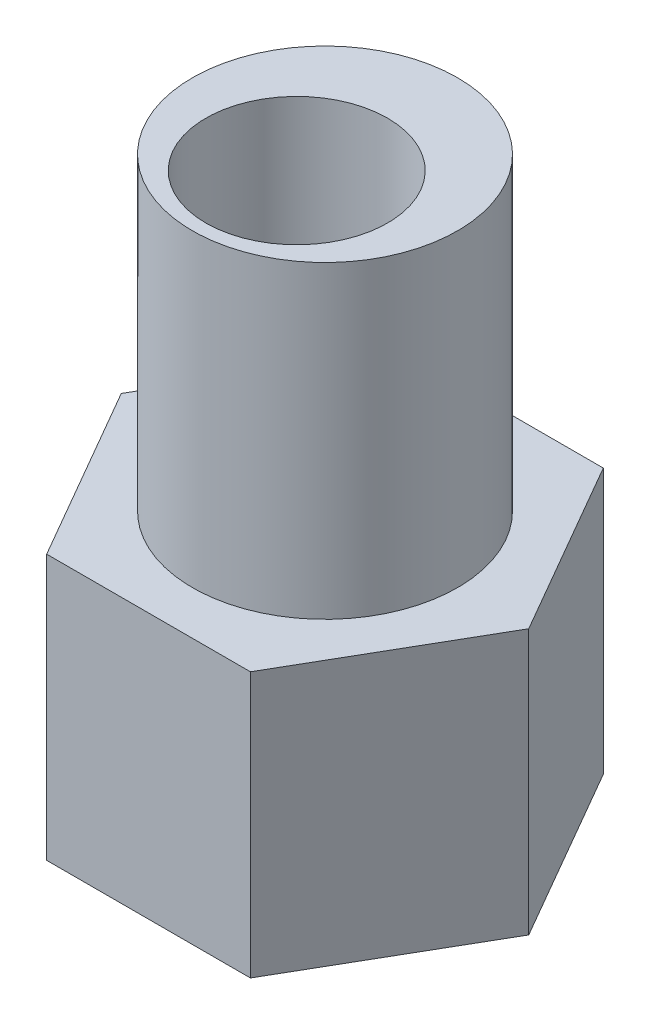
ISO-10303-21;
HEADER;
FILE_DESCRIPTION(('STEP AP214'),'2;1');
FILE_NAME('part.step','',(''),(''),'','','');
FILE_SCHEMA(('AUTOMOTIVE_DESIGN { 1 0 10303 214 1 1 1 1 }'));
ENDSEC;
DATA;
#1=APPLICATION_CONTEXT('core data for automotive mechanical design processes');
#2=APPLICATION_PROTOCOL_DEFINITION('international standard','automotive_design',2000,#1);
#3=PRODUCT_CONTEXT('',#1,'mechanical');
#4=PRODUCT('Part','Part','',(#3));
#5=PRODUCT_RELATED_PRODUCT_CATEGORY('part','',(#4));
#6=PRODUCT_DEFINITION_FORMATION('','',#4);
#7=PRODUCT_DEFINITION_CONTEXT('part definition',#1,'design');
#8=PRODUCT_DEFINITION('design','',#6,#7);
#9=PRODUCT_DEFINITION_SHAPE('','',#8);
#10=(LENGTH_UNIT() NAMED_UNIT(*) SI_UNIT(.MILLI.,.METRE.));
#11=(NAMED_UNIT(*) PLANE_ANGLE_UNIT() SI_UNIT($,.RADIAN.));
#12=(NAMED_UNIT(*) SI_UNIT($,.STERADIAN.) SOLID_ANGLE_UNIT());
#13=UNCERTAINTY_MEASURE_WITH_UNIT(LENGTH_MEASURE(1.E-05),#10,'distance_accuracy_value','');
#14=(GEOMETRIC_REPRESENTATION_CONTEXT(3) GLOBAL_UNCERTAINTY_ASSIGNED_CONTEXT((#13)) GLOBAL_UNIT_ASSIGNED_CONTEXT((#10,
#11,#12)) REPRESENTATION_CONTEXT('',''));
#15=CARTESIAN_POINT('',(0.,0.,0.));
#16=DIRECTION('',(0.,0.,1.));
#17=DIRECTION('',(1.,0.,0.));
#18=AXIS2_PLACEMENT_3D('',#15,#16,#17);
#19=CARTESIAN_POINT('',(0.,9.525,0.));
#20=DIRECTION('',(0.,1.,0.));
#21=DIRECTION('',(0.,0.,1.));
#22=AXIS2_PLACEMENT_3D('',#19,#20,#21);
#23=PLANE('',#22);
#24=CARTESIAN_POINT('',(0.,9.525,0.));
#25=DIRECTION('',(0.,-1.,0.));
#26=DIRECTION('',(0.,0.,-1.));
#27=AXIS2_PLACEMENT_3D('',#24,#25,#26);
#28=CIRCLE('',#27,4.7625);
#29=CARTESIAN_POINT('',(0.,9.525,-4.7625));
#30=VERTEX_POINT('',#29);
#31=EDGE_CURVE('E21',#30,#30,#28,.F.);
#32=ORIENTED_EDGE('',*,*,#31,.F.);
#33=EDGE_LOOP('',(#32));
#34=FACE_BOUND('',#33,.T.);
#35=DIRECTION('',(0.5,0.,-0.866025403784439));
#36=VECTOR('',#35,1.);
#37=CARTESIAN_POINT('',(-3.65884186093542,9.525,-6.3373));
#38=LINE('',#37,#36);
#39=CARTESIAN_POINT('',(-3.65884186093542,9.525,-6.3373));
#40=VERTEX_POINT('',#39);
#41=CARTESIAN_POINT('',(-7.31768372187083,9.525,0.));
#42=VERTEX_POINT('',#41);
#43=EDGE_CURVE('E112',#40,#42,#38,.F.);
#44=ORIENTED_EDGE('',*,*,#43,.T.);
#45=DIRECTION('',(-0.5,0.,-0.866025403784439));
#46=VECTOR('',#45,1.);
#47=CARTESIAN_POINT('',(-7.31768372187083,9.525,0.));
#48=LINE('',#47,#46);
#49=CARTESIAN_POINT('',(-3.65884186093542,9.525,6.3373));
#50=VERTEX_POINT('',#49);
#51=EDGE_CURVE('E107',#42,#50,#48,.F.);
#52=ORIENTED_EDGE('',*,*,#51,.T.);
#53=DIRECTION('',(-1.,0.,0.));
#54=VECTOR('',#53,1.);
#55=CARTESIAN_POINT('',(-3.65884186093542,9.525,6.3373));
#56=LINE('',#55,#54);
#57=CARTESIAN_POINT('',(3.65884186093541,9.525,6.3373));
#58=VERTEX_POINT('',#57);
#59=EDGE_CURVE('E73',#50,#58,#56,.F.);
#60=ORIENTED_EDGE('',*,*,#59,.T.);
#61=DIRECTION('',(-0.5,0.,0.866025403784439));
#62=VECTOR('',#61,1.);
#63=CARTESIAN_POINT('',(3.65884186093542,9.525,6.3373));
#64=LINE('',#63,#62);
#65=CARTESIAN_POINT('',(7.31768372187083,9.525,0.));
#66=VERTEX_POINT('',#65);
#67=EDGE_CURVE('E72',#58,#66,#64,.F.);
#68=ORIENTED_EDGE('',*,*,#67,.T.);
#69=DIRECTION('',(0.5,0.,0.866025403784439));
#70=VECTOR('',#69,1.);
#71=CARTESIAN_POINT('',(7.31768372187083,9.525,0.));
#72=LINE('',#71,#70);
#73=CARTESIAN_POINT('',(3.65884186093542,9.525,-6.3373));
#74=VERTEX_POINT('',#73);
#75=EDGE_CURVE('E69',#66,#74,#72,.F.);
#76=ORIENTED_EDGE('',*,*,#75,.T.);
#77=DIRECTION('',(1.,0.,0.));
#78=VECTOR('',#77,1.);
#79=CARTESIAN_POINT('',(3.65884186093542,9.525,-6.3373));
#80=LINE('',#79,#78);
#81=EDGE_CURVE('E117',#74,#40,#80,.F.);
#82=ORIENTED_EDGE('',*,*,#81,.T.);
#83=EDGE_LOOP('',(#44,#52,#60,#68,#76,#82));
#84=FACE_BOUND('',#83,.T.);
#85=ADVANCED_FACE('F18',(#34,#84),#23,.T.);
#86=CARTESIAN_POINT('',(0.,20.6248,0.));
#87=DIRECTION('',(0.,-1.,0.));
#88=DIRECTION('',(0.,0.,-1.));
#89=AXIS2_PLACEMENT_3D('',#86,#87,#88);
#90=CYLINDRICAL_SURFACE('',#89,4.7625);
#91=ORIENTED_EDGE('',*,*,#31,.T.);
#92=EDGE_LOOP('',(#91));
#93=FACE_BOUND('',#92,.T.);
#94=CARTESIAN_POINT('',(0.,20.6248,0.));
#95=DIRECTION('',(0.,-1.,0.));
#96=DIRECTION('',(0.,0.,-1.));
#97=AXIS2_PLACEMENT_3D('',#94,#95,#96);
#98=CIRCLE('',#97,4.7625);
#99=CARTESIAN_POINT('',(0.,20.6248,-4.7625));
#100=VERTEX_POINT('',#99);
#101=EDGE_CURVE('E95',#100,#100,#98,.F.);
#102=ORIENTED_EDGE('',*,*,#101,.F.);
#103=EDGE_LOOP('',(#102));
#104=FACE_BOUND('',#103,.T.);
#105=ADVANCED_FACE('F224',(#93,#104),#90,.T.);
#106=CARTESIAN_POINT('',(3.65884186093542,9.525,6.3373));
#107=DIRECTION('',(-0.866025403784439,0.,-0.5));
#108=DIRECTION('',(-0.5,0.,0.866025403784439));
#109=AXIS2_PLACEMENT_3D('',#106,#107,#108);
#110=PLANE('',#109);
#111=DIRECTION('',(0.,1.,0.));
#112=VECTOR('',#111,1.);
#113=CARTESIAN_POINT('',(7.31768372187083,9.525,0.));
#114=LINE('',#113,#112);
#115=CARTESIAN_POINT('',(7.31768372187083,0.,0.));
#116=VERTEX_POINT('',#115);
#117=EDGE_CURVE('E78',#116,#66,#114,.T.);
#118=ORIENTED_EDGE('',*,*,#117,.T.);
#119=ORIENTED_EDGE('',*,*,#67,.F.);
#120=DIRECTION('',(0.,1.,0.));
#121=VECTOR('',#120,1.);
#122=CARTESIAN_POINT('',(3.65884186093542,9.525,6.3373));
#123=LINE('',#122,#121);
#124=CARTESIAN_POINT('',(3.65884186093542,0.,6.3373));
#125=VERTEX_POINT('',#124);
#126=EDGE_CURVE('E97',#58,#125,#123,.F.);
#127=ORIENTED_EDGE('',*,*,#126,.T.);
#128=DIRECTION('',(0.5,0.,-0.866025403784439));
#129=VECTOR('',#128,1.);
#130=CARTESIAN_POINT('',(3.65884186093542,0.,6.3373));
#131=LINE('',#130,#129);
#132=EDGE_CURVE('E89',#125,#116,#131,.T.);
#133=ORIENTED_EDGE('',*,*,#132,.T.);
#134=EDGE_LOOP('',(#118,#119,#127,#133));
#135=FACE_BOUND('',#134,.T.);
#136=ADVANCED_FACE('F88',(#135),#110,.F.);
#137=CARTESIAN_POINT('',(7.31768372187083,9.525,0.));
#138=DIRECTION('',(-0.866025403784439,0.,0.5));
#139=DIRECTION('',(0.5,0.,0.866025403784439));
#140=AXIS2_PLACEMENT_3D('',#137,#138,#139);
#141=PLANE('',#140);
#142=DIRECTION('',(0.,1.,0.));
#143=VECTOR('',#142,1.);
#144=CARTESIAN_POINT('',(3.65884186093542,9.525,-6.3373));
#145=LINE('',#144,#143);
#146=CARTESIAN_POINT('',(3.65884186093542,0.,-6.3373));
#147=VERTEX_POINT('',#146);
#148=EDGE_CURVE('E85',#147,#74,#145,.T.);
#149=ORIENTED_EDGE('',*,*,#148,.T.);
#150=ORIENTED_EDGE('',*,*,#75,.F.);
#151=ORIENTED_EDGE('',*,*,#117,.F.);
#152=DIRECTION('',(-0.5,0.,-0.866025403784439));
#153=VECTOR('',#152,1.);
#154=CARTESIAN_POINT('',(7.31768372187083,0.,0.));
#155=LINE('',#154,#153);
#156=EDGE_CURVE('E100',#116,#147,#155,.T.);
#157=ORIENTED_EDGE('',*,*,#156,.T.);
#158=EDGE_LOOP('',(#149,#150,#151,#157));
#159=FACE_BOUND('',#158,.T.);
#160=ADVANCED_FACE('F82',(#159),#141,.F.);
#161=CARTESIAN_POINT('',(3.65884186093542,9.525,-6.3373));
#162=DIRECTION('',(0.,0.,1.));
#163=DIRECTION('',(1.,0.,0.));
#164=AXIS2_PLACEMENT_3D('',#161,#162,#163);
#165=PLANE('',#164);
#166=DIRECTION('',(0.,1.,0.));
#167=VECTOR('',#166,1.);
#168=CARTESIAN_POINT('',(-3.65884186093542,9.525,-6.3373));
#169=LINE('',#168,#167);
#170=CARTESIAN_POINT('',(-3.65884186093542,0.,-6.3373));
#171=VERTEX_POINT('',#170);
#172=EDGE_CURVE('E114',#171,#40,#169,.T.);
#173=ORIENTED_EDGE('',*,*,#172,.T.);
#174=ORIENTED_EDGE('',*,*,#81,.F.);
#175=ORIENTED_EDGE('',*,*,#148,.F.);
#176=DIRECTION('',(1.,0.,0.));
#177=VECTOR('',#176,1.);
#178=CARTESIAN_POINT('',(0.,0.,-6.3373));
#179=LINE('',#178,#177);
#180=EDGE_CURVE('E128',#147,#171,#179,.F.);
#181=ORIENTED_EDGE('',*,*,#180,.T.);
#182=EDGE_LOOP('',(#173,#174,#175,#181));
#183=FACE_BOUND('',#182,.T.);
#184=ADVANCED_FACE('F126',(#183),#165,.F.);
#185=CARTESIAN_POINT('',(-3.65884186093542,9.525,-6.3373));
#186=DIRECTION('',(0.866025403784439,0.,0.5));
#187=DIRECTION('',(0.5,0.,-0.866025403784439));
#188=AXIS2_PLACEMENT_3D('',#185,#186,#187);
#189=PLANE('',#188);
#190=DIRECTION('',(0.,1.,0.));
#191=VECTOR('',#190,1.);
#192=CARTESIAN_POINT('',(-7.31768372187083,9.525,0.));
#193=LINE('',#192,#191);
#194=CARTESIAN_POINT('',(-7.31768372187083,0.,0.));
#195=VERTEX_POINT('',#194);
#196=EDGE_CURVE('E109',#195,#42,#193,.T.);
#197=ORIENTED_EDGE('',*,*,#196,.T.);
#198=ORIENTED_EDGE('',*,*,#43,.F.);
#199=ORIENTED_EDGE('',*,*,#172,.F.);
#200=DIRECTION('',(-0.5,0.,0.866025403784439));
#201=VECTOR('',#200,1.);
#202=CARTESIAN_POINT('',(-3.65884186093542,0.,-6.3373));
#203=LINE('',#202,#201);
#204=EDGE_CURVE('E130',#171,#195,#203,.T.);
#205=ORIENTED_EDGE('',*,*,#204,.T.);
#206=EDGE_LOOP('',(#197,#198,#199,#205));
#207=FACE_BOUND('',#206,.T.);
#208=ADVANCED_FACE('F122',(#207),#189,.F.);
#209=CARTESIAN_POINT('',(-7.31768372187083,9.525,0.));
#210=DIRECTION('',(0.866025403784439,0.,-0.5));
#211=DIRECTION('',(-0.5,0.,-0.866025403784439));
#212=AXIS2_PLACEMENT_3D('',#209,#210,#211);
#213=PLANE('',#212);
#214=DIRECTION('',(0.,1.,0.));
#215=VECTOR('',#214,1.);
#216=CARTESIAN_POINT('',(-3.65884186093542,9.525,6.3373));
#217=LINE('',#216,#215);
#218=CARTESIAN_POINT('',(-3.65884186093542,0.,6.3373));
#219=VERTEX_POINT('',#218);
#220=EDGE_CURVE('E36',#219,#50,#217,.T.);
#221=ORIENTED_EDGE('',*,*,#220,.T.);
#222=ORIENTED_EDGE('',*,*,#51,.F.);
#223=ORIENTED_EDGE('',*,*,#196,.F.);
#224=DIRECTION('',(0.5,0.,0.866025403784439));
#225=VECTOR('',#224,1.);
#226=CARTESIAN_POINT('',(-7.31768372187083,0.,0.));
#227=LINE('',#226,#225);
#228=EDGE_CURVE('E132',#195,#219,#227,.T.);
#229=ORIENTED_EDGE('',*,*,#228,.T.);
#230=EDGE_LOOP('',(#221,#222,#223,#229));
#231=FACE_BOUND('',#230,.T.);
#232=ADVANCED_FACE('F142',(#231),#213,.F.);
#233=CARTESIAN_POINT('',(-3.65884186093542,9.525,6.3373));
#234=DIRECTION('',(0.,0.,-1.));
#235=DIRECTION('',(-1.,0.,0.));
#236=AXIS2_PLACEMENT_3D('',#233,#234,#235);
#237=PLANE('',#236);
#238=ORIENTED_EDGE('',*,*,#126,.F.);
#239=ORIENTED_EDGE('',*,*,#59,.F.);
#240=ORIENTED_EDGE('',*,*,#220,.F.);
#241=DIRECTION('',(1.,0.,0.));
#242=VECTOR('',#241,1.);
#243=CARTESIAN_POINT('',(0.,0.,6.3373));
#244=LINE('',#243,#242);
#245=EDGE_CURVE('E94',#219,#125,#244,.T.);
#246=ORIENTED_EDGE('',*,*,#245,.T.);
#247=EDGE_LOOP('',(#238,#239,#240,#246));
#248=FACE_BOUND('',#247,.T.);
#249=ADVANCED_FACE('F137',(#248),#237,.F.);
#250=CARTESIAN_POINT('',(0.,20.6248,0.));
#251=DIRECTION('',(0.,1.,0.));
#252=DIRECTION('',(0.,0.,1.));
#253=AXIS2_PLACEMENT_3D('',#250,#251,#252);
#254=PLANE('',#253);
#255=ORIENTED_EDGE('',*,*,#101,.T.);
#256=EDGE_LOOP('',(#255));
#257=FACE_BOUND('',#256,.T.);
#258=CARTESIAN_POINT('',(0.,20.6248,1.016));
#259=DIRECTION('',(0.,1.,0.));
#260=DIRECTION('',(0.,0.,1.));
#261=AXIS2_PLACEMENT_3D('',#258,#259,#260);
#262=CIRCLE('',#261,3.2639);
#263=CARTESIAN_POINT('',(0.,20.6248,4.2799));
#264=VERTEX_POINT('',#263);
#265=EDGE_CURVE('E27',#264,#264,#262,.F.);
#266=ORIENTED_EDGE('',*,*,#265,.T.);
#267=EDGE_LOOP('',(#266));
#268=FACE_BOUND('',#267,.T.);
#269=ADVANCED_FACE('F150',(#257,#268),#254,.T.);
#270=CARTESIAN_POINT('',(0.,0.,0.));
#271=DIRECTION('',(0.,1.,0.));
#272=DIRECTION('',(0.,0.,1.));
#273=AXIS2_PLACEMENT_3D('',#270,#271,#272);
#274=PLANE('',#273);
#275=ORIENTED_EDGE('',*,*,#228,.F.);
#276=ORIENTED_EDGE('',*,*,#204,.F.);
#277=ORIENTED_EDGE('',*,*,#180,.F.);
#278=ORIENTED_EDGE('',*,*,#156,.F.);
#279=ORIENTED_EDGE('',*,*,#132,.F.);
#280=ORIENTED_EDGE('',*,*,#245,.F.);
#281=EDGE_LOOP('',(#275,#276,#277,#278,#279,#280));
#282=FACE_BOUND('',#281,.T.);
#283=CARTESIAN_POINT('',(0.,0.,1.016));
#284=DIRECTION('',(0.,1.,0.));
#285=DIRECTION('',(0.,0.,1.));
#286=AXIS2_PLACEMENT_3D('',#283,#284,#285);
#287=CIRCLE('',#286,3.2639);
#288=CARTESIAN_POINT('',(0.,0.,4.2799));
#289=VERTEX_POINT('',#288);
#290=EDGE_CURVE('E11',#289,#289,#287,.T.);
#291=ORIENTED_EDGE('',*,*,#290,.T.);
#292=EDGE_LOOP('',(#291));
#293=FACE_BOUND('',#292,.T.);
#294=ADVANCED_FACE('F139',(#282,#293),#274,.F.);
#295=CARTESIAN_POINT('',(0.,0.,1.016));
#296=DIRECTION('',(0.,1.,0.));
#297=DIRECTION('',(0.,0.,1.));
#298=AXIS2_PLACEMENT_3D('',#295,#296,#297);
#299=CYLINDRICAL_SURFACE('',#298,3.2639);
#300=ORIENTED_EDGE('',*,*,#265,.F.);
#301=EDGE_LOOP('',(#300));
#302=FACE_BOUND('',#301,.T.);
#303=ORIENTED_EDGE('',*,*,#290,.F.);
#304=EDGE_LOOP('',(#303));
#305=FACE_BOUND('',#304,.T.);
#306=ADVANCED_FACE('F153',(#302,#305),#299,.F.);
#307=CLOSED_SHELL('',(#85,#105,#136,#160,#184,#208,#232,#249,#269,#294,#306));
#308=MANIFOLD_SOLID_BREP('B1',#307);
#309=ADVANCED_BREP_SHAPE_REPRESENTATION('',(#18,#308),#14);
#310=SHAPE_DEFINITION_REPRESENTATION(#9,#309);
ENDSEC;
END-ISO-10303-21;
